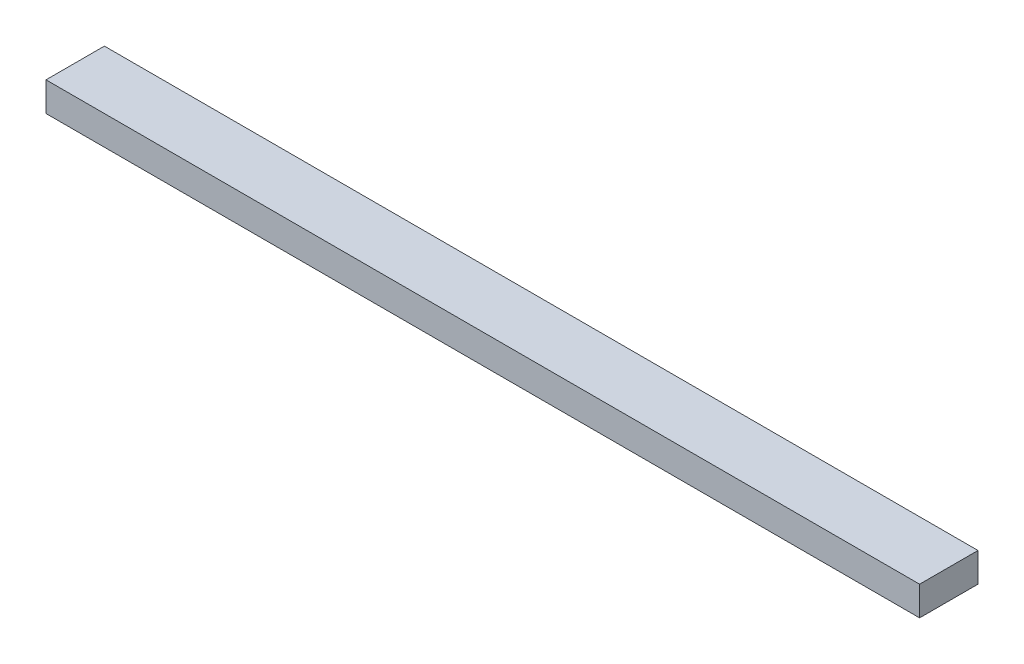
ISO-10303-21;
HEADER;
FILE_DESCRIPTION(('STEP AP214'),'2;1');
FILE_NAME('part.step','',(''),(''),'','','');
FILE_SCHEMA(('AUTOMOTIVE_DESIGN { 1 0 10303 214 1 1 1 1 }'));
ENDSEC;
DATA;
#1=APPLICATION_CONTEXT('core data for automotive mechanical design processes');
#2=APPLICATION_PROTOCOL_DEFINITION('international standard','automotive_design',2000,#1);
#3=PRODUCT_CONTEXT('',#1,'mechanical');
#4=PRODUCT('Part','Part','',(#3));
#5=PRODUCT_RELATED_PRODUCT_CATEGORY('part','',(#4));
#6=PRODUCT_DEFINITION_FORMATION('','',#4);
#7=PRODUCT_DEFINITION_CONTEXT('part definition',#1,'design');
#8=PRODUCT_DEFINITION('design','',#6,#7);
#9=PRODUCT_DEFINITION_SHAPE('','',#8);
#10=(LENGTH_UNIT() NAMED_UNIT(*) SI_UNIT(.MILLI.,.METRE.));
#11=(NAMED_UNIT(*) PLANE_ANGLE_UNIT() SI_UNIT($,.RADIAN.));
#12=(NAMED_UNIT(*) SI_UNIT($,.STERADIAN.) SOLID_ANGLE_UNIT());
#13=UNCERTAINTY_MEASURE_WITH_UNIT(LENGTH_MEASURE(1.E-05),#10,'distance_accuracy_value','');
#14=(GEOMETRIC_REPRESENTATION_CONTEXT(3) GLOBAL_UNCERTAINTY_ASSIGNED_CONTEXT((#13)) GLOBAL_UNIT_ASSIGNED_CONTEXT((#10,
#11,#12)) REPRESENTATION_CONTEXT('',''));
#15=CARTESIAN_POINT('',(0.,0.,0.));
#16=DIRECTION('',(0.,0.,1.));
#17=DIRECTION('',(1.,0.,0.));
#18=AXIS2_PLACEMENT_3D('',#15,#16,#17);
#19=CARTESIAN_POINT('',(0.,19.05,0.));
#20=DIRECTION('',(1.,0.,0.));
#21=DIRECTION('',(0.,0.,-1.));
#22=AXIS2_PLACEMENT_3D('',#19,#20,#21);
#23=PLANE('',#22);
#24=DIRECTION('',(0.,0.,1.));
#25=VECTOR('',#24,1.);
#26=CARTESIAN_POINT('',(0.,0.,0.));
#27=LINE('',#26,#25);
#28=CARTESIAN_POINT('',(0.,0.,-38.1));
#29=VERTEX_POINT('',#28);
#30=CARTESIAN_POINT('',(0.,0.,0.));
#31=VERTEX_POINT('',#30);
#32=EDGE_CURVE('E101',#29,#31,#27,.T.);
#33=ORIENTED_EDGE('',*,*,#32,.T.);
#34=DIRECTION('',(0.,-1.,0.));
#35=VECTOR('',#34,1.);
#36=CARTESIAN_POINT('',(0.,19.05,0.));
#37=LINE('',#36,#35);
#38=CARTESIAN_POINT('',(0.,19.05,0.));
#39=VERTEX_POINT('',#38);
#40=EDGE_CURVE('E11',#39,#31,#37,.T.);
#41=ORIENTED_EDGE('',*,*,#40,.F.);
#42=DIRECTION('',(0.,0.,1.));
#43=VECTOR('',#42,1.);
#44=CARTESIAN_POINT('',(0.,19.05,0.));
#45=LINE('',#44,#43);
#46=CARTESIAN_POINT('',(0.,19.05,-38.1));
#47=VERTEX_POINT('',#46);
#48=EDGE_CURVE('E89',#47,#39,#45,.T.);
#49=ORIENTED_EDGE('',*,*,#48,.F.);
#50=DIRECTION('',(0.,-1.,0.));
#51=VECTOR('',#50,1.);
#52=CARTESIAN_POINT('',(0.,19.05,-38.1));
#53=LINE('',#52,#51);
#54=EDGE_CURVE('E97',#47,#29,#53,.T.);
#55=ORIENTED_EDGE('',*,*,#54,.T.);
#56=EDGE_LOOP('',(#33,#41,#49,#55));
#57=FACE_BOUND('',#56,.T.);
#58=ADVANCED_FACE('F38',(#57),#23,.F.);
#59=CARTESIAN_POINT('',(0.,19.05,0.));
#60=DIRECTION('',(0.,0.,-1.));
#61=DIRECTION('',(-1.,0.,0.));
#62=AXIS2_PLACEMENT_3D('',#59,#60,#61);
#63=PLANE('',#62);
#64=DIRECTION('',(1.,0.,0.));
#65=VECTOR('',#64,1.);
#66=CARTESIAN_POINT('',(0.,0.,0.));
#67=LINE('',#66,#65);
#68=CARTESIAN_POINT('',(569.9125,0.,0.));
#69=VERTEX_POINT('',#68);
#70=EDGE_CURVE('E93',#31,#69,#67,.T.);
#71=ORIENTED_EDGE('',*,*,#70,.T.);
#72=DIRECTION('',(0.,-1.,0.));
#73=VECTOR('',#72,1.);
#74=CARTESIAN_POINT('',(569.9125,19.05,0.));
#75=LINE('',#74,#73);
#76=CARTESIAN_POINT('',(569.9125,19.05,0.));
#77=VERTEX_POINT('',#76);
#78=EDGE_CURVE('E46',#77,#69,#75,.T.);
#79=ORIENTED_EDGE('',*,*,#78,.F.);
#80=DIRECTION('',(1.,0.,0.));
#81=VECTOR('',#80,1.);
#82=CARTESIAN_POINT('',(0.,19.05,0.));
#83=LINE('',#82,#81);
#84=EDGE_CURVE('E84',#39,#77,#83,.T.);
#85=ORIENTED_EDGE('',*,*,#84,.F.);
#86=ORIENTED_EDGE('',*,*,#40,.T.);
#87=EDGE_LOOP('',(#71,#79,#85,#86));
#88=FACE_BOUND('',#87,.T.);
#89=ADVANCED_FACE('F92',(#88),#63,.F.);
#90=CARTESIAN_POINT('',(569.9125,19.05,0.));
#91=DIRECTION('',(-1.,0.,0.));
#92=DIRECTION('',(0.,0.,1.));
#93=AXIS2_PLACEMENT_3D('',#90,#91,#92);
#94=PLANE('',#93);
#95=DIRECTION('',(0.,0.,-1.));
#96=VECTOR('',#95,1.);
#97=CARTESIAN_POINT('',(569.9125,0.,0.));
#98=LINE('',#97,#96);
#99=CARTESIAN_POINT('',(569.9125,0.,-38.1));
#100=VERTEX_POINT('',#99);
#101=EDGE_CURVE('E71',#69,#100,#98,.T.);
#102=ORIENTED_EDGE('',*,*,#101,.T.);
#103=DIRECTION('',(0.,-1.,0.));
#104=VECTOR('',#103,1.);
#105=CARTESIAN_POINT('',(569.9125,19.05,-38.1));
#106=LINE('',#105,#104);
#107=CARTESIAN_POINT('',(569.9125,19.05,-38.1));
#108=VERTEX_POINT('',#107);
#109=EDGE_CURVE('E94',#108,#100,#106,.T.);
#110=ORIENTED_EDGE('',*,*,#109,.F.);
#111=DIRECTION('',(0.,0.,-1.));
#112=VECTOR('',#111,1.);
#113=CARTESIAN_POINT('',(569.9125,19.05,0.));
#114=LINE('',#113,#112);
#115=EDGE_CURVE('E87',#77,#108,#114,.T.);
#116=ORIENTED_EDGE('',*,*,#115,.F.);
#117=ORIENTED_EDGE('',*,*,#78,.T.);
#118=EDGE_LOOP('',(#102,#110,#116,#117));
#119=FACE_BOUND('',#118,.T.);
#120=ADVANCED_FACE('F95',(#119),#94,.F.);
#121=CARTESIAN_POINT('',(0.,19.05,-38.1));
#122=DIRECTION('',(0.,0.,1.));
#123=DIRECTION('',(1.,0.,0.));
#124=AXIS2_PLACEMENT_3D('',#121,#122,#123);
#125=PLANE('',#124);
#126=DIRECTION('',(-1.,0.,0.));
#127=VECTOR('',#126,1.);
#128=CARTESIAN_POINT('',(0.,0.,-38.1));
#129=LINE('',#128,#127);
#130=EDGE_CURVE('E77',#100,#29,#129,.T.);
#131=ORIENTED_EDGE('',*,*,#130,.T.);
#132=ORIENTED_EDGE('',*,*,#54,.F.);
#133=DIRECTION('',(-1.,0.,0.));
#134=VECTOR('',#133,1.);
#135=CARTESIAN_POINT('',(0.,19.05,-38.1));
#136=LINE('',#135,#134);
#137=EDGE_CURVE('E54',#108,#47,#136,.T.);
#138=ORIENTED_EDGE('',*,*,#137,.F.);
#139=ORIENTED_EDGE('',*,*,#109,.T.);
#140=EDGE_LOOP('',(#131,#132,#138,#139));
#141=FACE_BOUND('',#140,.T.);
#142=ADVANCED_FACE('F108',(#141),#125,.F.);
#143=CARTESIAN_POINT('',(0.,19.05,0.));
#144=DIRECTION('',(0.,-1.,0.));
#145=DIRECTION('',(0.,0.,-1.));
#146=AXIS2_PLACEMENT_3D('',#143,#144,#145);
#147=PLANE('',#146);
#148=ORIENTED_EDGE('',*,*,#48,.T.);
#149=ORIENTED_EDGE('',*,*,#84,.T.);
#150=ORIENTED_EDGE('',*,*,#115,.T.);
#151=ORIENTED_EDGE('',*,*,#137,.T.);
#152=EDGE_LOOP('',(#148,#149,#150,#151));
#153=FACE_BOUND('',#152,.T.);
#154=ADVANCED_FACE('F85',(#153),#147,.F.);
#155=CARTESIAN_POINT('',(0.,0.,0.));
#156=DIRECTION('',(0.,-1.,0.));
#157=DIRECTION('',(0.,0.,-1.));
#158=AXIS2_PLACEMENT_3D('',#155,#156,#157);
#159=PLANE('',#158);
#160=ORIENTED_EDGE('',*,*,#32,.F.);
#161=ORIENTED_EDGE('',*,*,#130,.F.);
#162=ORIENTED_EDGE('',*,*,#101,.F.);
#163=ORIENTED_EDGE('',*,*,#70,.F.);
#164=EDGE_LOOP('',(#160,#161,#162,#163));
#165=FACE_BOUND('',#164,.T.);
#166=ADVANCED_FACE('F111',(#165),#159,.T.);
#167=CLOSED_SHELL('',(#58,#89,#120,#142,#154,#166));
#168=MANIFOLD_SOLID_BREP('B2',#167);
#169=ADVANCED_BREP_SHAPE_REPRESENTATION('',(#18,#168),#14);
#170=SHAPE_DEFINITION_REPRESENTATION(#9,#169);
ENDSEC;
END-ISO-10303-21;
